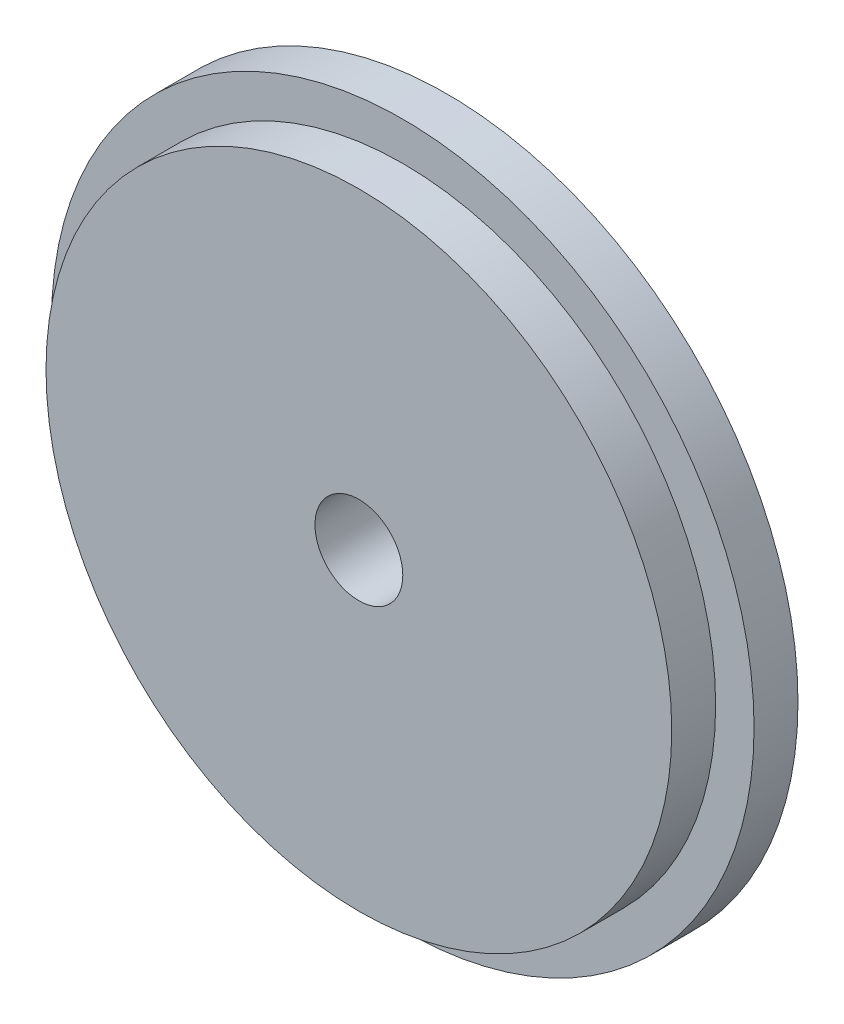
ISO-10303-21;
HEADER;
FILE_DESCRIPTION(('STEP AP214'),'2;1');
FILE_NAME('part.step','',(''),(''),'','','');
FILE_SCHEMA(('AUTOMOTIVE_DESIGN { 1 0 10303 214 1 1 1 1 }'));
ENDSEC;
DATA;
#1=APPLICATION_CONTEXT('core data for automotive mechanical design processes');
#2=APPLICATION_PROTOCOL_DEFINITION('international standard','automotive_design',2000,#1);
#3=PRODUCT_CONTEXT('',#1,'mechanical');
#4=PRODUCT('Part','Part','',(#3));
#5=PRODUCT_RELATED_PRODUCT_CATEGORY('part','',(#4));
#6=PRODUCT_DEFINITION_FORMATION('','',#4);
#7=PRODUCT_DEFINITION_CONTEXT('part definition',#1,'design');
#8=PRODUCT_DEFINITION('design','',#6,#7);
#9=PRODUCT_DEFINITION_SHAPE('','',#8);
#10=(LENGTH_UNIT() NAMED_UNIT(*) SI_UNIT(.MILLI.,.METRE.));
#11=(NAMED_UNIT(*) PLANE_ANGLE_UNIT() SI_UNIT($,.RADIAN.));
#12=(NAMED_UNIT(*) SI_UNIT($,.STERADIAN.) SOLID_ANGLE_UNIT());
#13=UNCERTAINTY_MEASURE_WITH_UNIT(LENGTH_MEASURE(1.E-05),#10,'distance_accuracy_value','');
#14=(GEOMETRIC_REPRESENTATION_CONTEXT(3) GLOBAL_UNCERTAINTY_ASSIGNED_CONTEXT((#13)) GLOBAL_UNIT_ASSIGNED_CONTEXT((#10,
#11,#12)) REPRESENTATION_CONTEXT('',''));
#15=CARTESIAN_POINT('',(0.,0.,0.));
#16=DIRECTION('',(0.,0.,1.));
#17=DIRECTION('',(1.,0.,0.));
#18=AXIS2_PLACEMENT_3D('',#15,#16,#17);
#19=CARTESIAN_POINT('',(0.,0.,2.));
#20=DIRECTION('',(0.,0.,-1.));
#21=DIRECTION('',(-1.,0.,0.));
#22=AXIS2_PLACEMENT_3D('',#19,#20,#21);
#23=CYLINDRICAL_SURFACE('',#22,16.);
#24=CARTESIAN_POINT('',(0.,0.,2.));
#25=DIRECTION('',(0.,0.,1.));
#26=DIRECTION('',(1.,0.,0.));
#27=AXIS2_PLACEMENT_3D('',#24,#25,#26);
#28=CIRCLE('',#27,16.);
#29=CARTESIAN_POINT('',(16.,0.,2.));
#30=VERTEX_POINT('',#29);
#31=EDGE_CURVE('E38',#30,#30,#28,.T.);
#32=ORIENTED_EDGE('',*,*,#31,.F.);
#33=EDGE_LOOP('',(#32));
#34=FACE_BOUND('',#33,.T.);
#35=CARTESIAN_POINT('',(0.,0.,0.));
#36=DIRECTION('',(0.,0.,1.));
#37=DIRECTION('',(1.,0.,0.));
#38=AXIS2_PLACEMENT_3D('',#35,#36,#37);
#39=CIRCLE('',#38,16.);
#40=CARTESIAN_POINT('',(16.,0.,0.));
#41=VERTEX_POINT('',#40);
#42=EDGE_CURVE('E34',#41,#41,#39,.T.);
#43=ORIENTED_EDGE('',*,*,#42,.T.);
#44=EDGE_LOOP('',(#43));
#45=FACE_BOUND('',#44,.T.);
#46=ADVANCED_FACE('F31',(#34,#45),#23,.T.);
#47=CARTESIAN_POINT('',(0.,0.,2.));
#48=DIRECTION('',(0.,0.,1.));
#49=DIRECTION('',(1.,0.,0.));
#50=AXIS2_PLACEMENT_3D('',#47,#48,#49);
#51=PLANE('',#50);
#52=CARTESIAN_POINT('',(0.,0.,2.));
#53=DIRECTION('',(0.,0.,1.));
#54=DIRECTION('',(1.,0.,0.));
#55=AXIS2_PLACEMENT_3D('',#52,#53,#54);
#56=CIRCLE('',#55,14.25);
#57=CARTESIAN_POINT('',(14.25,0.,2.));
#58=VERTEX_POINT('',#57);
#59=EDGE_CURVE('E10',#58,#58,#56,.T.);
#60=ORIENTED_EDGE('',*,*,#59,.F.);
#61=EDGE_LOOP('',(#60));
#62=FACE_BOUND('',#61,.T.);
#63=ORIENTED_EDGE('',*,*,#31,.T.);
#64=EDGE_LOOP('',(#63));
#65=FACE_BOUND('',#64,.T.);
#66=ADVANCED_FACE('F75',(#62,#65),#51,.T.);
#67=CARTESIAN_POINT('',(0.,0.,0.));
#68=DIRECTION('',(0.,0.,1.));
#69=DIRECTION('',(1.,0.,0.));
#70=AXIS2_PLACEMENT_3D('',#67,#68,#69);
#71=PLANE('',#70);
#72=CARTESIAN_POINT('',(0.,0.,0.));
#73=DIRECTION('',(0.,0.,1.));
#74=DIRECTION('',(1.,0.,0.));
#75=AXIS2_PLACEMENT_3D('',#72,#73,#74);
#76=CIRCLE('',#75,2.);
#77=CARTESIAN_POINT('',(2.,0.,0.));
#78=VERTEX_POINT('',#77);
#79=EDGE_CURVE('E47',#78,#78,#76,.T.);
#80=ORIENTED_EDGE('',*,*,#79,.T.);
#81=EDGE_LOOP('',(#80));
#82=FACE_BOUND('',#81,.T.);
#83=ORIENTED_EDGE('',*,*,#42,.F.);
#84=EDGE_LOOP('',(#83));
#85=FACE_BOUND('',#84,.T.);
#86=ADVANCED_FACE('F54',(#82,#85),#71,.F.);
#87=CARTESIAN_POINT('',(0.,0.,4.));
#88=DIRECTION('',(0.,0.,-1.));
#89=DIRECTION('',(-1.,0.,0.));
#90=AXIS2_PLACEMENT_3D('',#87,#88,#89);
#91=CYLINDRICAL_SURFACE('',#90,14.25);
#92=CARTESIAN_POINT('',(0.,0.,4.));
#93=DIRECTION('',(0.,0.,1.));
#94=DIRECTION('',(1.,0.,0.));
#95=AXIS2_PLACEMENT_3D('',#92,#93,#94);
#96=CIRCLE('',#95,14.25);
#97=CARTESIAN_POINT('',(14.25,0.,4.));
#98=VERTEX_POINT('',#97);
#99=EDGE_CURVE('E44',#98,#98,#96,.T.);
#100=ORIENTED_EDGE('',*,*,#99,.F.);
#101=EDGE_LOOP('',(#100));
#102=FACE_BOUND('',#101,.T.);
#103=ORIENTED_EDGE('',*,*,#59,.T.);
#104=EDGE_LOOP('',(#103));
#105=FACE_BOUND('',#104,.T.);
#106=ADVANCED_FACE('F66',(#102,#105),#91,.T.);
#107=CARTESIAN_POINT('',(0.,0.,4.));
#108=DIRECTION('',(0.,0.,1.));
#109=DIRECTION('',(1.,0.,0.));
#110=AXIS2_PLACEMENT_3D('',#107,#108,#109);
#111=PLANE('',#110);
#112=CARTESIAN_POINT('',(0.,0.,4.));
#113=DIRECTION('',(0.,0.,1.));
#114=DIRECTION('',(1.,0.,0.));
#115=AXIS2_PLACEMENT_3D('',#112,#113,#114);
#116=CIRCLE('',#115,2.);
#117=CARTESIAN_POINT('',(2.,0.,4.));
#118=VERTEX_POINT('',#117);
#119=EDGE_CURVE('E48',#118,#118,#116,.T.);
#120=ORIENTED_EDGE('',*,*,#119,.F.);
#121=EDGE_LOOP('',(#120));
#122=FACE_BOUND('',#121,.T.);
#123=ORIENTED_EDGE('',*,*,#99,.T.);
#124=EDGE_LOOP('',(#123));
#125=FACE_BOUND('',#124,.T.);
#126=ADVANCED_FACE('F60',(#122,#125),#111,.T.);
#127=CARTESIAN_POINT('',(0.,0.,0.));
#128=DIRECTION('',(0.,0.,1.));
#129=DIRECTION('',(1.,0.,0.));
#130=AXIS2_PLACEMENT_3D('',#127,#128,#129);
#131=CYLINDRICAL_SURFACE('',#130,2.);
#132=ORIENTED_EDGE('',*,*,#79,.F.);
#133=EDGE_LOOP('',(#132));
#134=FACE_BOUND('',#133,.T.);
#135=ORIENTED_EDGE('',*,*,#119,.T.);
#136=EDGE_LOOP('',(#135));
#137=FACE_BOUND('',#136,.T.);
#138=ADVANCED_FACE('F57',(#134,#137),#131,.F.);
#139=CLOSED_SHELL('',(#46,#66,#86,#106,#126,#138));
#140=MANIFOLD_SOLID_BREP('B2',#139);
#141=ADVANCED_BREP_SHAPE_REPRESENTATION('',(#18,#140),#14);
#142=SHAPE_DEFINITION_REPRESENTATION(#9,#141);
ENDSEC;
END-ISO-10303-21;
